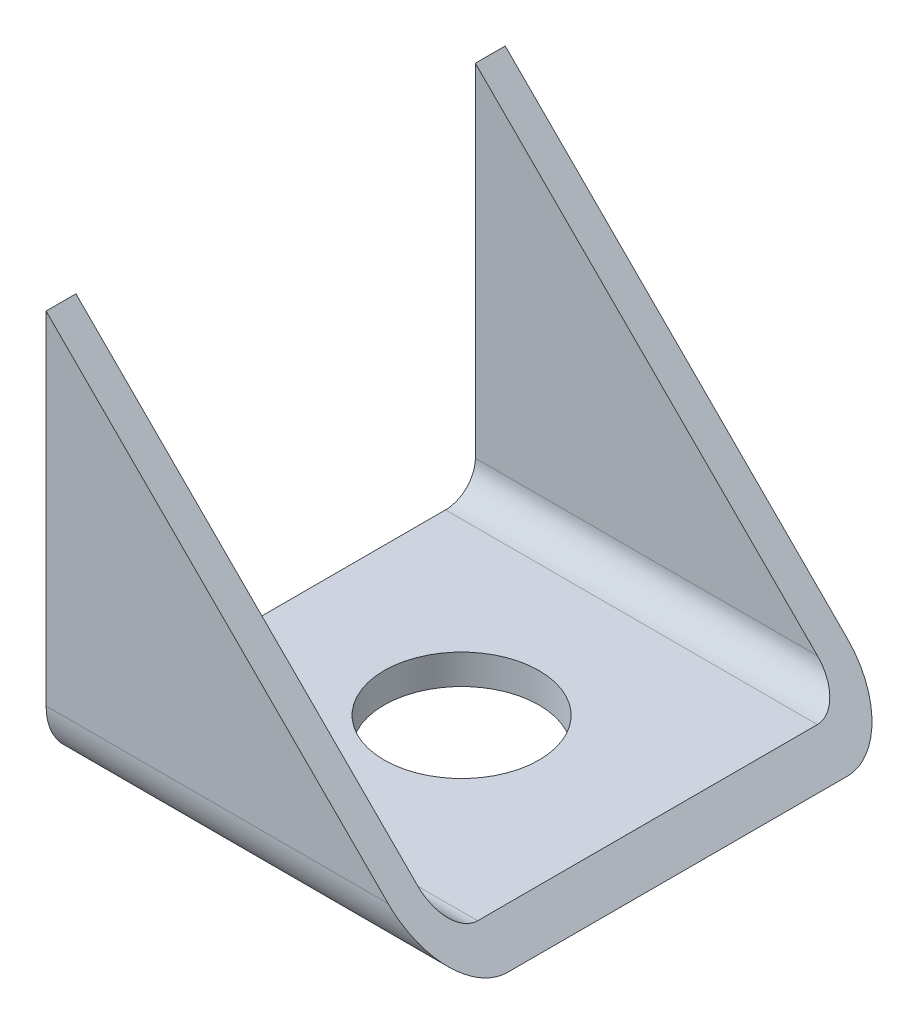
ISO-10303-21;
HEADER;
FILE_DESCRIPTION(('STEP AP214'),'2;1');
FILE_NAME('part.step','',(''),(''),'','','');
FILE_SCHEMA(('AUTOMOTIVE_DESIGN { 1 0 10303 214 1 1 1 1 }'));
ENDSEC;
DATA;
#1=APPLICATION_CONTEXT('core data for automotive mechanical design processes');
#2=APPLICATION_PROTOCOL_DEFINITION('international standard','automotive_design',2000,#1);
#3=PRODUCT_CONTEXT('',#1,'mechanical');
#4=PRODUCT('Part','Part','',(#3));
#5=PRODUCT_RELATED_PRODUCT_CATEGORY('part','',(#4));
#6=PRODUCT_DEFINITION_FORMATION('','',#4);
#7=PRODUCT_DEFINITION_CONTEXT('part definition',#1,'design');
#8=PRODUCT_DEFINITION('design','',#6,#7);
#9=PRODUCT_DEFINITION_SHAPE('','',#8);
#10=(LENGTH_UNIT() NAMED_UNIT(*) SI_UNIT(.MILLI.,.METRE.));
#11=(NAMED_UNIT(*) PLANE_ANGLE_UNIT() SI_UNIT($,.RADIAN.));
#12=(NAMED_UNIT(*) SI_UNIT($,.STERADIAN.) SOLID_ANGLE_UNIT());
#13=UNCERTAINTY_MEASURE_WITH_UNIT(LENGTH_MEASURE(1.E-05),#10,'distance_accuracy_value','');
#14=(GEOMETRIC_REPRESENTATION_CONTEXT(3) GLOBAL_UNCERTAINTY_ASSIGNED_CONTEXT((#13)) GLOBAL_UNIT_ASSIGNED_CONTEXT((#10,
#11,#12)) REPRESENTATION_CONTEXT('',''));
#15=CARTESIAN_POINT('',(0.,0.,0.));
#16=DIRECTION('',(0.,0.,1.));
#17=DIRECTION('',(1.,0.,0.));
#18=AXIS2_PLACEMENT_3D('',#15,#16,#17);
#19=CARTESIAN_POINT('',(35.,14.8,14.8));
#20=DIRECTION('',(-1.,0.,0.));
#21=DIRECTION('',(0.,0.,1.));
#22=AXIS2_PLACEMENT_3D('',#19,#20,#21);
#23=CYLINDRICAL_SURFACE('',#22,5.2);
#24=DIRECTION('',(-1.,0.,0.));
#25=VECTOR('',#24,1.);
#26=CARTESIAN_POINT('',(35.,14.8,20.));
#27=LINE('',#26,#25);
#28=CARTESIAN_POINT('',(0.199999999999602,14.8,20.));
#29=VERTEX_POINT('',#28);
#30=CARTESIAN_POINT('',(0.,14.8,20.));
#31=VERTEX_POINT('',#30);
#32=EDGE_CURVE('E180',#29,#31,#27,.T.);
#33=ORIENTED_EDGE('',*,*,#32,.F.);
#34=CARTESIAN_POINT('',(0.199999999999603,14.8,14.8));
#35=DIRECTION('',(-0.707106781186543,-0.707106781186551,0.));
#36=DIRECTION('',(-0.707106781186551,0.707106781186544,0.));
#37=AXIS2_PLACEMENT_3D('',#34,#35,#36);
#38=ELLIPSE('',#37,7.35391052434014,5.2);
#39=CARTESIAN_POINT('',(0.,14.9999999999996,19.9961524227067));
#40=VERTEX_POINT('',#39);
#41=EDGE_CURVE('E164',#29,#40,#38,.T.);
#42=ORIENTED_EDGE('',*,*,#41,.T.);
#43=CARTESIAN_POINT('',(0.,14.8,14.8));
#44=DIRECTION('',(1.,0.,0.));
#45=DIRECTION('',(0.,0.,-1.));
#46=AXIS2_PLACEMENT_3D('',#43,#44,#45);
#47=CIRCLE('',#46,5.2);
#48=EDGE_CURVE('E185',#40,#31,#47,.T.);
#49=ORIENTED_EDGE('',*,*,#48,.T.);
#50=EDGE_LOOP('',(#33,#42,#49));
#51=FACE_BOUND('',#50,.T.);
#52=ADVANCED_FACE('F64',(#51),#23,.T.);
#53=CARTESIAN_POINT('',(35.,14.8,20.));
#54=DIRECTION('',(0.,0.,-1.));
#55=DIRECTION('',(0.,1.,0.));
#56=AXIS2_PLACEMENT_3D('',#53,#54,#55);
#57=PLANE('',#56);
#58=DIRECTION('',(-1.,0.,0.));
#59=VECTOR('',#58,1.);
#60=CARTESIAN_POINT('',(35.,-14.8,20.));
#61=LINE('',#60,#59);
#62=CARTESIAN_POINT('',(29.8,-14.8,20.));
#63=VERTEX_POINT('',#62);
#64=CARTESIAN_POINT('',(0.,-14.8,20.));
#65=VERTEX_POINT('',#64);
#66=EDGE_CURVE('E181',#63,#65,#61,.T.);
#67=ORIENTED_EDGE('',*,*,#66,.F.);
#68=DIRECTION('',(0.707106781186551,-0.707106781186544,0.));
#69=VECTOR('',#68,1.);
#70=CARTESIAN_POINT('',(-5.00000000000045,20.,20.));
#71=LINE('',#70,#69);
#72=EDGE_CURVE('E167',#29,#63,#71,.T.);
#73=ORIENTED_EDGE('',*,*,#72,.F.);
#74=ORIENTED_EDGE('',*,*,#32,.T.);
#75=DIRECTION('',(0.,-1.,0.));
#76=VECTOR('',#75,1.);
#77=CARTESIAN_POINT('',(0.,14.8,20.));
#78=LINE('',#77,#76);
#79=EDGE_CURVE('E237',#31,#65,#78,.T.);
#80=ORIENTED_EDGE('',*,*,#79,.T.);
#81=EDGE_LOOP('',(#67,#73,#74,#80));
#82=FACE_BOUND('',#81,.T.);
#83=ADVANCED_FACE('F178',(#82),#57,.F.);
#84=CARTESIAN_POINT('',(35.,-14.8,14.8));
#85=DIRECTION('',(-1.,0.,0.));
#86=DIRECTION('',(0.,0.,1.));
#87=AXIS2_PLACEMENT_3D('',#84,#85,#86);
#88=CYLINDRICAL_SURFACE('',#87,5.2);
#89=DIRECTION('',(-1.,0.,0.));
#90=VECTOR('',#89,1.);
#91=CARTESIAN_POINT('',(35.,-20.,14.8));
#92=LINE('',#91,#90);
#93=CARTESIAN_POINT('',(35.,-20.,14.8));
#94=VERTEX_POINT('',#93);
#95=CARTESIAN_POINT('',(0.,-20.,14.8));
#96=VERTEX_POINT('',#95);
#97=EDGE_CURVE('E188',#94,#96,#92,.T.);
#98=ORIENTED_EDGE('',*,*,#97,.F.);
#99=CARTESIAN_POINT('',(29.7999999999999,-14.8,14.8));
#100=DIRECTION('',(-0.707106781186543,-0.707106781186551,0.));
#101=DIRECTION('',(-0.707106781186551,0.707106781186544,0.));
#102=AXIS2_PLACEMENT_3D('',#99,#100,#101);
#103=ELLIPSE('',#102,7.35391052434014,5.2);
#104=EDGE_CURVE('E246',#94,#63,#103,.T.);
#105=ORIENTED_EDGE('',*,*,#104,.T.);
#106=ORIENTED_EDGE('',*,*,#66,.T.);
#107=CARTESIAN_POINT('',(0.,-14.8,14.8));
#108=DIRECTION('',(1.,0.,0.));
#109=DIRECTION('',(0.,0.,-1.));
#110=AXIS2_PLACEMENT_3D('',#107,#108,#109);
#111=CIRCLE('',#110,5.2);
#112=EDGE_CURVE('E230',#65,#96,#111,.T.);
#113=ORIENTED_EDGE('',*,*,#112,.T.);
#114=EDGE_LOOP('',(#98,#105,#106,#113));
#115=FACE_BOUND('',#114,.T.);
#116=ADVANCED_FACE('F314',(#115),#88,.T.);
#117=CARTESIAN_POINT('',(35.,-20.,-14.8));
#118=DIRECTION('',(0.,1.,0.));
#119=DIRECTION('',(0.,0.,1.));
#120=AXIS2_PLACEMENT_3D('',#117,#118,#119);
#121=PLANE('',#120);
#122=CARTESIAN_POINT('',(16.2,-20.,0.));
#123=DIRECTION('',(0.,1.,0.));
#124=DIRECTION('',(0.,0.,1.));
#125=AXIS2_PLACEMENT_3D('',#122,#123,#124);
#126=CIRCLE('',#125,6.75);
#127=CARTESIAN_POINT('',(16.2,-20.,6.74999999999999));
#128=VERTEX_POINT('',#127);
#129=EDGE_CURVE('E183',#128,#128,#126,.T.);
#130=ORIENTED_EDGE('',*,*,#129,.T.);
#131=EDGE_LOOP('',(#130));
#132=FACE_BOUND('',#131,.T.);
#133=DIRECTION('',(0.,0.,-1.));
#134=VECTOR('',#133,1.);
#135=CARTESIAN_POINT('',(0.,-20.,-14.8));
#136=LINE('',#135,#134);
#137=CARTESIAN_POINT('',(0.,-20.,-14.8));
#138=VERTEX_POINT('',#137);
#139=EDGE_CURVE('E224',#96,#138,#136,.T.);
#140=ORIENTED_EDGE('',*,*,#139,.T.);
#141=DIRECTION('',(-1.,0.,0.));
#142=VECTOR('',#141,1.);
#143=CARTESIAN_POINT('',(35.,-20.,-14.8));
#144=LINE('',#143,#142);
#145=CARTESIAN_POINT('',(35.,-20.,-14.8));
#146=VERTEX_POINT('',#145);
#147=EDGE_CURVE('E210',#146,#138,#144,.T.);
#148=ORIENTED_EDGE('',*,*,#147,.F.);
#149=DIRECTION('',(0.,0.,-1.));
#150=VECTOR('',#149,1.);
#151=CARTESIAN_POINT('',(35.,-20.,-14.8));
#152=LINE('',#151,#150);
#153=EDGE_CURVE('E195',#94,#146,#152,.T.);
#154=ORIENTED_EDGE('',*,*,#153,.F.);
#155=ORIENTED_EDGE('',*,*,#97,.T.);
#156=EDGE_LOOP('',(#140,#148,#154,#155));
#157=FACE_BOUND('',#156,.T.);
#158=ADVANCED_FACE('F222',(#132,#157),#121,.F.);
#159=CARTESIAN_POINT('',(35.,-14.8,-14.8));
#160=DIRECTION('',(-1.,0.,0.));
#161=DIRECTION('',(0.,0.,1.));
#162=AXIS2_PLACEMENT_3D('',#159,#160,#161);
#163=CYLINDRICAL_SURFACE('',#162,5.2);
#164=DIRECTION('',(-1.,0.,0.));
#165=VECTOR('',#164,1.);
#166=CARTESIAN_POINT('',(35.,-14.8,-20.));
#167=LINE('',#166,#165);
#168=CARTESIAN_POINT('',(29.8,-14.8,-20.));
#169=VERTEX_POINT('',#168);
#170=CARTESIAN_POINT('',(0.,-14.8,-20.));
#171=VERTEX_POINT('',#170);
#172=EDGE_CURVE('E208',#169,#171,#167,.T.);
#173=ORIENTED_EDGE('',*,*,#172,.F.);
#174=CARTESIAN_POINT('',(29.7999999999999,-14.8,-14.8));
#175=DIRECTION('',(-0.707106781186543,-0.707106781186551,0.));
#176=DIRECTION('',(-0.707106781186551,0.707106781186544,0.));
#177=AXIS2_PLACEMENT_3D('',#174,#175,#176);
#178=ELLIPSE('',#177,7.35391052434014,5.2);
#179=EDGE_CURVE('E173',#169,#146,#178,.T.);
#180=ORIENTED_EDGE('',*,*,#179,.T.);
#181=ORIENTED_EDGE('',*,*,#147,.T.);
#182=CARTESIAN_POINT('',(0.,-14.8,-14.8));
#183=DIRECTION('',(1.,0.,0.));
#184=DIRECTION('',(0.,0.,-1.));
#185=AXIS2_PLACEMENT_3D('',#182,#183,#184);
#186=CIRCLE('',#185,5.2);
#187=EDGE_CURVE('E233',#138,#171,#186,.T.);
#188=ORIENTED_EDGE('',*,*,#187,.T.);
#189=EDGE_LOOP('',(#173,#180,#181,#188));
#190=FACE_BOUND('',#189,.T.);
#191=ADVANCED_FACE('F321',(#190),#163,.T.);
#192=CARTESIAN_POINT('',(35.,-14.8,-20.));
#193=DIRECTION('',(0.,0.,1.));
#194=DIRECTION('',(0.,-1.,0.));
#195=AXIS2_PLACEMENT_3D('',#192,#193,#194);
#196=PLANE('',#195);
#197=DIRECTION('',(-1.,0.,0.));
#198=VECTOR('',#197,1.);
#199=CARTESIAN_POINT('',(35.,14.8,-20.));
#200=LINE('',#199,#198);
#201=CARTESIAN_POINT('',(0.199999999999605,14.8,-20.));
#202=VERTEX_POINT('',#201);
#203=CARTESIAN_POINT('',(0.,14.8,-20.));
#204=VERTEX_POINT('',#203);
#205=EDGE_CURVE('E86',#202,#204,#200,.T.);
#206=ORIENTED_EDGE('',*,*,#205,.F.);
#207=DIRECTION('',(0.707106781186551,-0.707106781186544,0.));
#208=VECTOR('',#207,1.);
#209=CARTESIAN_POINT('',(-5.00000000000045,20.,-20.));
#210=LINE('',#209,#208);
#211=EDGE_CURVE('E182',#202,#169,#210,.T.);
#212=ORIENTED_EDGE('',*,*,#211,.T.);
#213=ORIENTED_EDGE('',*,*,#172,.T.);
#214=DIRECTION('',(0.,1.,0.));
#215=VECTOR('',#214,1.);
#216=CARTESIAN_POINT('',(0.,-14.8,-20.));
#217=LINE('',#216,#215);
#218=EDGE_CURVE('E235',#171,#204,#217,.T.);
#219=ORIENTED_EDGE('',*,*,#218,.T.);
#220=EDGE_LOOP('',(#206,#212,#213,#219));
#221=FACE_BOUND('',#220,.T.);
#222=ADVANCED_FACE('F348',(#221),#196,.F.);
#223=CARTESIAN_POINT('',(35.,14.8,-14.8));
#224=DIRECTION('',(-1.,0.,0.));
#225=DIRECTION('',(0.,0.,1.));
#226=AXIS2_PLACEMENT_3D('',#223,#224,#225);
#227=CYLINDRICAL_SURFACE('',#226,5.2);
#228=CARTESIAN_POINT('',(0.,14.8,-14.8));
#229=DIRECTION('',(1.,0.,0.));
#230=DIRECTION('',(0.,0.,-1.));
#231=AXIS2_PLACEMENT_3D('',#228,#229,#230);
#232=CIRCLE('',#231,5.2);
#233=CARTESIAN_POINT('',(0.,14.9999999999996,-19.9961524227067));
#234=VERTEX_POINT('',#233);
#235=EDGE_CURVE('E213',#204,#234,#232,.T.);
#236=ORIENTED_EDGE('',*,*,#235,.T.);
#237=CARTESIAN_POINT('',(0.199999999999603,14.8,-14.8));
#238=DIRECTION('',(-0.707106781186543,-0.707106781186551,0.));
#239=DIRECTION('',(-0.707106781186551,0.707106781186544,0.));
#240=AXIS2_PLACEMENT_3D('',#237,#238,#239);
#241=ELLIPSE('',#240,7.35391052434014,5.2);
#242=EDGE_CURVE('E79',#234,#202,#241,.T.);
#243=ORIENTED_EDGE('',*,*,#242,.T.);
#244=ORIENTED_EDGE('',*,*,#205,.T.);
#245=EDGE_LOOP('',(#236,#243,#244));
#246=FACE_BOUND('',#245,.T.);
#247=ADVANCED_FACE('F344',(#246),#227,.T.);
#248=CARTESIAN_POINT('',(35.,-14.8,14.8));
#249=DIRECTION('',(-1.,0.,0.));
#250=DIRECTION('',(0.,0.,1.));
#251=AXIS2_PLACEMENT_3D('',#248,#249,#250);
#252=CYLINDRICAL_SURFACE('',#251,2.60000000000001);
#253=CARTESIAN_POINT('',(29.7999999999999,-14.8,14.8));
#254=DIRECTION('',(-0.707106781186543,-0.707106781186551,0.));
#255=DIRECTION('',(-0.707106781186551,0.707106781186544,0.));
#256=AXIS2_PLACEMENT_3D('',#253,#254,#255);
#257=ELLIPSE('',#256,3.67695526217008,2.60000000000001);
#258=CARTESIAN_POINT('',(32.4,-17.4,14.8));
#259=VERTEX_POINT('',#258);
#260=CARTESIAN_POINT('',(29.7999999999999,-14.8,17.4));
#261=VERTEX_POINT('',#260);
#262=EDGE_CURVE('E309',#259,#261,#257,.T.);
#263=ORIENTED_EDGE('',*,*,#262,.F.);
#264=DIRECTION('',(-1.,0.,0.));
#265=VECTOR('',#264,1.);
#266=CARTESIAN_POINT('',(35.,-17.4,14.8));
#267=LINE('',#266,#265);
#268=CARTESIAN_POINT('',(0.,-17.4,14.8));
#269=VERTEX_POINT('',#268);
#270=EDGE_CURVE('E192',#259,#269,#267,.T.);
#271=ORIENTED_EDGE('',*,*,#270,.T.);
#272=CARTESIAN_POINT('',(0.,-14.8,14.8));
#273=DIRECTION('',(1.,0.,0.));
#274=DIRECTION('',(0.,0.,-1.));
#275=AXIS2_PLACEMENT_3D('',#272,#273,#274);
#276=CIRCLE('',#275,2.60000000000001);
#277=CARTESIAN_POINT('',(0.,-14.8,17.4));
#278=VERTEX_POINT('',#277);
#279=EDGE_CURVE('E248',#278,#269,#276,.T.);
#280=ORIENTED_EDGE('',*,*,#279,.F.);
#281=DIRECTION('',(-1.,0.,0.));
#282=VECTOR('',#281,1.);
#283=CARTESIAN_POINT('',(35.,-14.8,17.4));
#284=LINE('',#283,#282);
#285=EDGE_CURVE('E202',#261,#278,#284,.T.);
#286=ORIENTED_EDGE('',*,*,#285,.F.);
#287=EDGE_LOOP('',(#263,#271,#280,#286));
#288=FACE_BOUND('',#287,.T.);
#289=ADVANCED_FACE('F66',(#288),#252,.F.);
#290=CARTESIAN_POINT('',(35.,14.8,17.4));
#291=DIRECTION('',(0.,0.,-1.));
#292=DIRECTION('',(0.,1.,0.));
#293=AXIS2_PLACEMENT_3D('',#290,#291,#292);
#294=PLANE('',#293);
#295=DIRECTION('',(-0.707106781186551,0.707106781186544,0.));
#296=VECTOR('',#295,1.);
#297=CARTESIAN_POINT('',(17.6,-2.6000000000002,17.4));
#298=LINE('',#297,#296);
#299=CARTESIAN_POINT('',(0.199999999999614,14.8,17.4));
#300=VERTEX_POINT('',#299);
#301=EDGE_CURVE('E275',#261,#300,#298,.T.);
#302=ORIENTED_EDGE('',*,*,#301,.F.);
#303=ORIENTED_EDGE('',*,*,#285,.T.);
#304=DIRECTION('',(0.,-1.,0.));
#305=VECTOR('',#304,1.);
#306=CARTESIAN_POINT('',(0.,14.8,17.4));
#307=LINE('',#306,#305);
#308=CARTESIAN_POINT('',(0.,14.8,17.4));
#309=VERTEX_POINT('',#308);
#310=EDGE_CURVE('E251',#309,#278,#307,.T.);
#311=ORIENTED_EDGE('',*,*,#310,.F.);
#312=DIRECTION('',(-1.,0.,0.));
#313=VECTOR('',#312,1.);
#314=CARTESIAN_POINT('',(35.,14.8,17.4));
#315=LINE('',#314,#313);
#316=EDGE_CURVE('E201',#300,#309,#315,.T.);
#317=ORIENTED_EDGE('',*,*,#316,.F.);
#318=EDGE_LOOP('',(#302,#303,#311,#317));
#319=FACE_BOUND('',#318,.T.);
#320=ADVANCED_FACE('F274',(#319),#294,.T.);
#321=CARTESIAN_POINT('',(35.,14.8,14.8));
#322=DIRECTION('',(-1.,0.,0.));
#323=DIRECTION('',(0.,0.,1.));
#324=AXIS2_PLACEMENT_3D('',#321,#322,#323);
#325=CYLINDRICAL_SURFACE('',#324,2.6);
#326=CARTESIAN_POINT('',(0.199999999999603,14.8,14.8));
#327=DIRECTION('',(-0.707106781186543,-0.707106781186551,0.));
#328=DIRECTION('',(-0.707106781186551,0.707106781186544,0.));
#329=AXIS2_PLACEMENT_3D('',#326,#327,#328);
#330=ELLIPSE('',#329,3.67695526217008,2.6);
#331=CARTESIAN_POINT('',(0.,14.9999999999996,17.3922962793632));
#332=VERTEX_POINT('',#331);
#333=EDGE_CURVE('E174',#300,#332,#330,.T.);
#334=ORIENTED_EDGE('',*,*,#333,.F.);
#335=ORIENTED_EDGE('',*,*,#316,.T.);
#336=CARTESIAN_POINT('',(0.,14.8,14.8));
#337=DIRECTION('',(1.,0.,0.));
#338=DIRECTION('',(0.,0.,-1.));
#339=AXIS2_PLACEMENT_3D('',#336,#337,#338);
#340=CIRCLE('',#339,2.6);
#341=EDGE_CURVE('E254',#332,#309,#340,.T.);
#342=ORIENTED_EDGE('',*,*,#341,.F.);
#343=EDGE_LOOP('',(#334,#335,#342));
#344=FACE_BOUND('',#343,.T.);
#345=ADVANCED_FACE('F272',(#344),#325,.F.);
#346=CARTESIAN_POINT('',(35.,14.8,-14.8));
#347=DIRECTION('',(-1.,0.,0.));
#348=DIRECTION('',(0.,0.,1.));
#349=AXIS2_PLACEMENT_3D('',#346,#347,#348);
#350=CYLINDRICAL_SURFACE('',#349,2.6);
#351=CARTESIAN_POINT('',(0.199999999999603,14.8,-14.8));
#352=DIRECTION('',(-0.707106781186543,-0.707106781186551,0.));
#353=DIRECTION('',(-0.707106781186551,0.707106781186544,0.));
#354=AXIS2_PLACEMENT_3D('',#351,#352,#353);
#355=ELLIPSE('',#354,3.67695526217008,2.6);
#356=CARTESIAN_POINT('',(0.,14.9999999999996,-17.3922962793632));
#357=VERTEX_POINT('',#356);
#358=CARTESIAN_POINT('',(0.199999999999617,14.8,-17.4));
#359=VERTEX_POINT('',#358);
#360=EDGE_CURVE('E299',#357,#359,#355,.T.);
#361=ORIENTED_EDGE('',*,*,#360,.F.);
#362=CARTESIAN_POINT('',(0.,14.8,-14.8));
#363=DIRECTION('',(1.,0.,0.));
#364=DIRECTION('',(0.,0.,-1.));
#365=AXIS2_PLACEMENT_3D('',#362,#363,#364);
#366=CIRCLE('',#365,2.6);
#367=CARTESIAN_POINT('',(0.,14.8,-17.4));
#368=VERTEX_POINT('',#367);
#369=EDGE_CURVE('E257',#368,#357,#366,.T.);
#370=ORIENTED_EDGE('',*,*,#369,.F.);
#371=DIRECTION('',(-1.,0.,0.));
#372=VECTOR('',#371,1.);
#373=CARTESIAN_POINT('',(35.,14.8,-17.4));
#374=LINE('',#373,#372);
#375=EDGE_CURVE('E199',#359,#368,#374,.T.);
#376=ORIENTED_EDGE('',*,*,#375,.F.);
#377=EDGE_LOOP('',(#361,#370,#376));
#378=FACE_BOUND('',#377,.T.);
#379=ADVANCED_FACE('F298',(#378),#350,.F.);
#380=CARTESIAN_POINT('',(35.,-14.8,-17.4));
#381=DIRECTION('',(0.,0.,1.));
#382=DIRECTION('',(0.,-1.,0.));
#383=AXIS2_PLACEMENT_3D('',#380,#381,#382);
#384=PLANE('',#383);
#385=DIRECTION('',(0.707106781186551,-0.707106781186544,0.));
#386=VECTOR('',#385,1.);
#387=CARTESIAN_POINT('',(32.4,-17.4,-17.4));
#388=LINE('',#387,#386);
#389=CARTESIAN_POINT('',(29.7999999999999,-14.8,-17.4));
#390=VERTEX_POINT('',#389);
#391=EDGE_CURVE('E295',#359,#390,#388,.T.);
#392=ORIENTED_EDGE('',*,*,#391,.F.);
#393=ORIENTED_EDGE('',*,*,#375,.T.);
#394=DIRECTION('',(0.,1.,0.));
#395=VECTOR('',#394,1.);
#396=CARTESIAN_POINT('',(0.,-14.8,-17.4));
#397=LINE('',#396,#395);
#398=CARTESIAN_POINT('',(0.,-14.8,-17.4));
#399=VERTEX_POINT('',#398);
#400=EDGE_CURVE('E260',#399,#368,#397,.T.);
#401=ORIENTED_EDGE('',*,*,#400,.F.);
#402=DIRECTION('',(-1.,0.,0.));
#403=VECTOR('',#402,1.);
#404=CARTESIAN_POINT('',(35.,-14.8,-17.4));
#405=LINE('',#404,#403);
#406=EDGE_CURVE('E197',#390,#399,#405,.T.);
#407=ORIENTED_EDGE('',*,*,#406,.F.);
#408=EDGE_LOOP('',(#392,#393,#401,#407));
#409=FACE_BOUND('',#408,.T.);
#410=ADVANCED_FACE('F293',(#409),#384,.T.);
#411=CARTESIAN_POINT('',(35.,-14.8,-14.8));
#412=DIRECTION('',(-1.,0.,0.));
#413=DIRECTION('',(0.,0.,1.));
#414=AXIS2_PLACEMENT_3D('',#411,#412,#413);
#415=CYLINDRICAL_SURFACE('',#414,2.6);
#416=CARTESIAN_POINT('',(29.7999999999999,-14.8,-14.8));
#417=DIRECTION('',(-0.707106781186543,-0.707106781186551,0.));
#418=DIRECTION('',(-0.707106781186551,0.707106781186544,0.));
#419=AXIS2_PLACEMENT_3D('',#416,#417,#418);
#420=ELLIPSE('',#419,3.67695526217007,2.6);
#421=CARTESIAN_POINT('',(32.4,-17.4,-14.8));
#422=VERTEX_POINT('',#421);
#423=EDGE_CURVE('E306',#390,#422,#420,.T.);
#424=ORIENTED_EDGE('',*,*,#423,.F.);
#425=ORIENTED_EDGE('',*,*,#406,.T.);
#426=CARTESIAN_POINT('',(0.,-14.8,-14.8));
#427=DIRECTION('',(1.,0.,0.));
#428=DIRECTION('',(0.,0.,-1.));
#429=AXIS2_PLACEMENT_3D('',#426,#427,#428);
#430=CIRCLE('',#429,2.6);
#431=CARTESIAN_POINT('',(0.,-17.4,-14.8));
#432=VERTEX_POINT('',#431);
#433=EDGE_CURVE('E263',#432,#399,#430,.T.);
#434=ORIENTED_EDGE('',*,*,#433,.F.);
#435=DIRECTION('',(-1.,0.,0.));
#436=VECTOR('',#435,1.);
#437=CARTESIAN_POINT('',(35.,-17.4,-14.8));
#438=LINE('',#437,#436);
#439=EDGE_CURVE('E194',#422,#432,#438,.T.);
#440=ORIENTED_EDGE('',*,*,#439,.F.);
#441=EDGE_LOOP('',(#424,#425,#434,#440));
#442=FACE_BOUND('',#441,.T.);
#443=ADVANCED_FACE('F287',(#442),#415,.F.);
#444=CARTESIAN_POINT('',(35.,-17.4,-14.8));
#445=DIRECTION('',(0.,1.,0.));
#446=DIRECTION('',(0.,0.,1.));
#447=AXIS2_PLACEMENT_3D('',#444,#445,#446);
#448=PLANE('',#447);
#449=CARTESIAN_POINT('',(16.2,-17.4,0.));
#450=DIRECTION('',(0.,1.,0.));
#451=DIRECTION('',(0.,0.,1.));
#452=AXIS2_PLACEMENT_3D('',#449,#450,#451);
#453=CIRCLE('',#452,6.75);
#454=CARTESIAN_POINT('',(16.2,-17.4,6.74999999999999));
#455=VERTEX_POINT('',#454);
#456=EDGE_CURVE('E456',#455,#455,#453,.T.);
#457=ORIENTED_EDGE('',*,*,#456,.F.);
#458=EDGE_LOOP('',(#457));
#459=FACE_BOUND('',#458,.T.);
#460=DIRECTION('',(0.,0.,1.));
#461=VECTOR('',#460,1.);
#462=CARTESIAN_POINT('',(32.4,-17.4,-14.8));
#463=LINE('',#462,#461);
#464=EDGE_CURVE('E284',#422,#259,#463,.T.);
#465=ORIENTED_EDGE('',*,*,#464,.F.);
#466=ORIENTED_EDGE('',*,*,#439,.T.);
#467=DIRECTION('',(0.,0.,-1.));
#468=VECTOR('',#467,1.);
#469=CARTESIAN_POINT('',(0.,-17.4,-14.8));
#470=LINE('',#469,#468);
#471=EDGE_CURVE('E266',#269,#432,#470,.T.);
#472=ORIENTED_EDGE('',*,*,#471,.F.);
#473=ORIENTED_EDGE('',*,*,#270,.F.);
#474=EDGE_LOOP('',(#465,#466,#472,#473));
#475=FACE_BOUND('',#474,.T.);
#476=ADVANCED_FACE('F281',(#459,#475),#448,.T.);
#477=CARTESIAN_POINT('',(0.,14.8,14.8));
#478=DIRECTION('',(1.,0.,0.));
#479=DIRECTION('',(0.,0.,-1.));
#480=AXIS2_PLACEMENT_3D('',#477,#478,#479);
#481=PLANE('',#480);
#482=ORIENTED_EDGE('',*,*,#48,.F.);
#483=DIRECTION('',(0.,0.,-1.));
#484=VECTOR('',#483,1.);
#485=CARTESIAN_POINT('',(0.,14.9999999999996,14.8));
#486=LINE('',#485,#484);
#487=EDGE_CURVE('E12',#40,#332,#486,.T.);
#488=ORIENTED_EDGE('',*,*,#487,.T.);
#489=ORIENTED_EDGE('',*,*,#341,.T.);
#490=ORIENTED_EDGE('',*,*,#310,.T.);
#491=ORIENTED_EDGE('',*,*,#279,.T.);
#492=ORIENTED_EDGE('',*,*,#471,.T.);
#493=ORIENTED_EDGE('',*,*,#433,.T.);
#494=ORIENTED_EDGE('',*,*,#400,.T.);
#495=ORIENTED_EDGE('',*,*,#369,.T.);
#496=EDGE_CURVE('E68',#357,#234,#486,.T.);
#497=ORIENTED_EDGE('',*,*,#496,.T.);
#498=ORIENTED_EDGE('',*,*,#235,.F.);
#499=ORIENTED_EDGE('',*,*,#218,.F.);
#500=ORIENTED_EDGE('',*,*,#187,.F.);
#501=ORIENTED_EDGE('',*,*,#139,.F.);
#502=ORIENTED_EDGE('',*,*,#112,.F.);
#503=ORIENTED_EDGE('',*,*,#79,.F.);
#504=EDGE_LOOP('',(#482,#488,#489,#490,#491,#492,#493,#494,#495,#497,#498,#499,#500,#501,#502,#503));
#505=FACE_BOUND('',#504,.T.);
#506=ADVANCED_FACE('F229',(#505),#481,.F.);
#507=CARTESIAN_POINT('',(-5.00000000000045,20.,-20.));
#508=DIRECTION('',(-0.707106781186543,-0.707106781186551,0.));
#509=DIRECTION('',(0.707106781186551,-0.707106781186544,0.));
#510=AXIS2_PLACEMENT_3D('',#507,#508,#509);
#511=PLANE('',#510);
#512=ORIENTED_EDGE('',*,*,#153,.T.);
#513=ORIENTED_EDGE('',*,*,#179,.F.);
#514=ORIENTED_EDGE('',*,*,#211,.F.);
#515=ORIENTED_EDGE('',*,*,#242,.F.);
#516=ORIENTED_EDGE('',*,*,#496,.F.);
#517=ORIENTED_EDGE('',*,*,#360,.T.);
#518=ORIENTED_EDGE('',*,*,#391,.T.);
#519=ORIENTED_EDGE('',*,*,#423,.T.);
#520=ORIENTED_EDGE('',*,*,#464,.T.);
#521=ORIENTED_EDGE('',*,*,#262,.T.);
#522=ORIENTED_EDGE('',*,*,#301,.T.);
#523=ORIENTED_EDGE('',*,*,#333,.T.);
#524=ORIENTED_EDGE('',*,*,#487,.F.);
#525=ORIENTED_EDGE('',*,*,#41,.F.);
#526=ORIENTED_EDGE('',*,*,#72,.T.);
#527=ORIENTED_EDGE('',*,*,#104,.F.);
#528=EDGE_LOOP('',(#512,#513,#514,#515,#516,#517,#518,#519,#520,#521,#522,#523,#524,#525,#526,#527));
#529=FACE_BOUND('',#528,.T.);
#530=ADVANCED_FACE('F166',(#529),#511,.F.);
#531=CARTESIAN_POINT('',(16.2,-17.4,0.));
#532=DIRECTION('',(0.,1.,0.));
#533=DIRECTION('',(0.,0.,1.));
#534=AXIS2_PLACEMENT_3D('',#531,#532,#533);
#535=CYLINDRICAL_SURFACE('',#534,6.75);
#536=ORIENTED_EDGE('',*,*,#456,.T.);
#537=EDGE_LOOP('',(#536));
#538=FACE_BOUND('',#537,.T.);
#539=ORIENTED_EDGE('',*,*,#129,.F.);
#540=EDGE_LOOP('',(#539));
#541=FACE_BOUND('',#540,.T.);
#542=ADVANCED_FACE('F428',(#538,#541),#535,.F.);
#543=CLOSED_SHELL('',(#52,#83,#116,#158,#191,#222,#247,#289,#320,#345,#379,#410,#443,#476,#506,
#530,#542));
#544=MANIFOLD_SOLID_BREP('B2',#543);
#545=ADVANCED_BREP_SHAPE_REPRESENTATION('',(#18,#544),#14);
#546=SHAPE_DEFINITION_REPRESENTATION(#9,#545);
ENDSEC;
END-ISO-10303-21;
